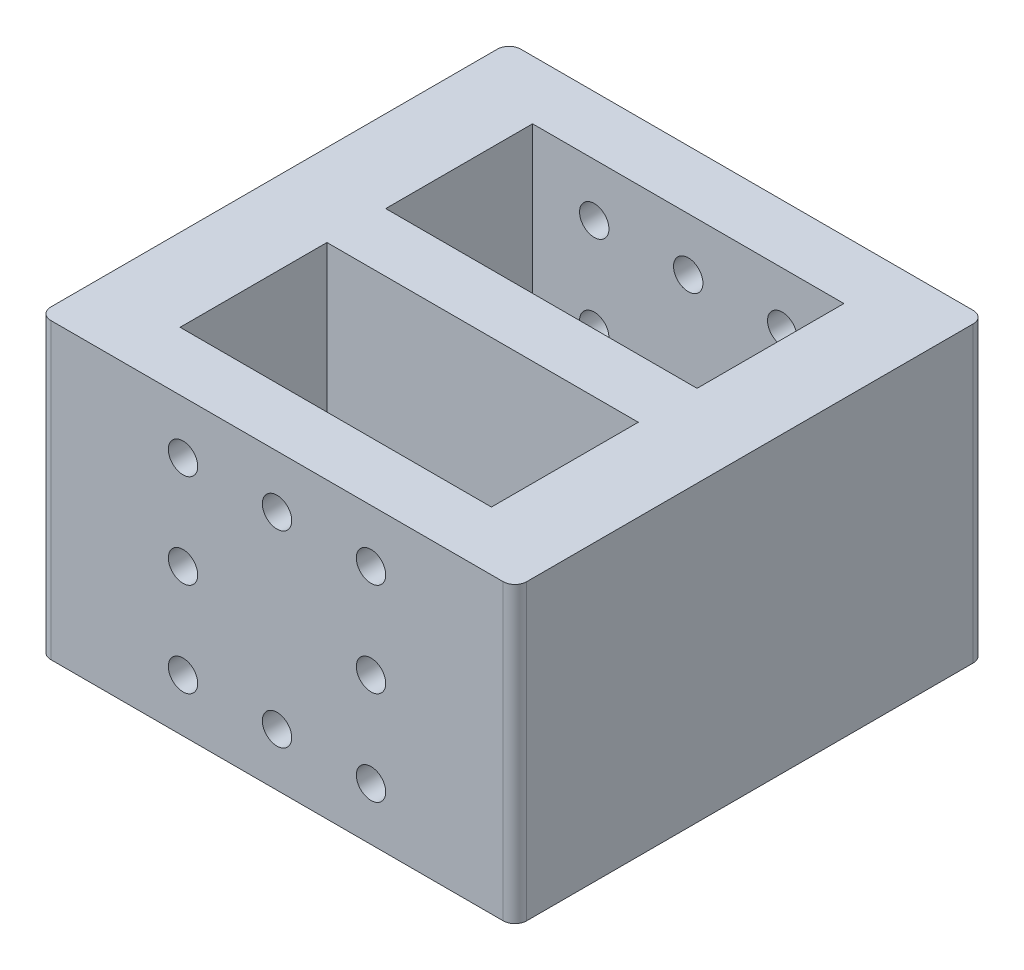
ISO-10303-21;
HEADER;
FILE_DESCRIPTION(('STEP AP214'),'2;1');
FILE_NAME('part.step','',(''),(''),'','','');
FILE_SCHEMA(('AUTOMOTIVE_DESIGN { 1 0 10303 214 1 1 1 1 }'));
ENDSEC;
DATA;
#1=APPLICATION_CONTEXT('core data for automotive mechanical design processes');
#2=APPLICATION_PROTOCOL_DEFINITION('international standard','automotive_design',2000,#1);
#3=PRODUCT_CONTEXT('',#1,'mechanical');
#4=PRODUCT('Part','Part','',(#3));
#5=PRODUCT_RELATED_PRODUCT_CATEGORY('part','',(#4));
#6=PRODUCT_DEFINITION_FORMATION('','',#4);
#7=PRODUCT_DEFINITION_CONTEXT('part definition',#1,'design');
#8=PRODUCT_DEFINITION('design','',#6,#7);
#9=PRODUCT_DEFINITION_SHAPE('','',#8);
#10=(LENGTH_UNIT() NAMED_UNIT(*) SI_UNIT(.MILLI.,.METRE.));
#11=(NAMED_UNIT(*) PLANE_ANGLE_UNIT() SI_UNIT($,.RADIAN.));
#12=(NAMED_UNIT(*) SI_UNIT($,.STERADIAN.) SOLID_ANGLE_UNIT());
#13=UNCERTAINTY_MEASURE_WITH_UNIT(LENGTH_MEASURE(1.E-05),#10,'distance_accuracy_value','');
#14=(GEOMETRIC_REPRESENTATION_CONTEXT(3) GLOBAL_UNCERTAINTY_ASSIGNED_CONTEXT((#13)) GLOBAL_UNIT_ASSIGNED_CONTEXT((#10,
#11,#12)) REPRESENTATION_CONTEXT('',''));
#15=CARTESIAN_POINT('',(0.,0.,0.));
#16=DIRECTION('',(0.,0.,1.));
#17=DIRECTION('',(1.,0.,0.));
#18=AXIS2_PLACEMENT_3D('',#15,#16,#17);
#19=CARTESIAN_POINT('',(6.99999999999999,25.,5.));
#20=DIRECTION('',(-1.,0.,0.));
#21=DIRECTION('',(0.,-1.,0.));
#22=AXIS2_PLACEMENT_3D('',#19,#20,#21);
#23=PLANE('',#22);
#24=DIRECTION('',(0.,1.,0.));
#25=VECTOR('',#24,1.);
#26=CARTESIAN_POINT('',(6.99999999999999,25.,17.5));
#27=LINE('',#26,#25);
#28=CARTESIAN_POINT('',(7.,0.,17.5));
#29=VERTEX_POINT('',#28);
#30=CARTESIAN_POINT('',(7.,25.,17.5));
#31=VERTEX_POINT('',#30);
#32=EDGE_CURVE('E182',#29,#31,#27,.T.);
#33=ORIENTED_EDGE('',*,*,#32,.F.);
#34=DIRECTION('',(0.,0.,1.));
#35=VECTOR('',#34,1.);
#36=CARTESIAN_POINT('',(7.,0.,5.));
#37=LINE('',#36,#35);
#38=CARTESIAN_POINT('',(7.,0.,5.));
#39=VERTEX_POINT('',#38);
#40=EDGE_CURVE('E162',#39,#29,#37,.T.);
#41=ORIENTED_EDGE('',*,*,#40,.F.);
#42=DIRECTION('',(0.,-1.,0.));
#43=VECTOR('',#42,1.);
#44=CARTESIAN_POINT('',(6.99999999999999,25.,5.));
#45=LINE('',#44,#43);
#46=CARTESIAN_POINT('',(6.99999999999999,25.,5.));
#47=VERTEX_POINT('',#46);
#48=EDGE_CURVE('E293',#47,#39,#45,.T.);
#49=ORIENTED_EDGE('',*,*,#48,.F.);
#50=DIRECTION('',(0.,0.,1.));
#51=VECTOR('',#50,1.);
#52=CARTESIAN_POINT('',(6.99999999999999,25.,5.));
#53=LINE('',#52,#51);
#54=EDGE_CURVE('E322',#47,#31,#53,.T.);
#55=ORIENTED_EDGE('',*,*,#54,.T.);
#56=EDGE_LOOP('',(#33,#41,#49,#55));
#57=FACE_BOUND('',#56,.T.);
#58=ADVANCED_FACE('F41',(#57),#23,.F.);
#59=CARTESIAN_POINT('',(33.5,25.,5.));
#60=DIRECTION('',(1.,0.,0.));
#61=DIRECTION('',(0.,1.,0.));
#62=AXIS2_PLACEMENT_3D('',#59,#60,#61);
#63=PLANE('',#62);
#64=DIRECTION('',(0.,-1.,0.));
#65=VECTOR('',#64,1.);
#66=CARTESIAN_POINT('',(33.5,25.,17.5));
#67=LINE('',#66,#65);
#68=CARTESIAN_POINT('',(33.5,25.,17.5));
#69=VERTEX_POINT('',#68);
#70=CARTESIAN_POINT('',(33.5,0.,17.5));
#71=VERTEX_POINT('',#70);
#72=EDGE_CURVE('E50',#69,#71,#67,.T.);
#73=ORIENTED_EDGE('',*,*,#72,.F.);
#74=DIRECTION('',(0.,0.,1.));
#75=VECTOR('',#74,1.);
#76=CARTESIAN_POINT('',(33.5,25.,5.));
#77=LINE('',#76,#75);
#78=CARTESIAN_POINT('',(33.5,25.,5.));
#79=VERTEX_POINT('',#78);
#80=EDGE_CURVE('E328',#79,#69,#77,.T.);
#81=ORIENTED_EDGE('',*,*,#80,.F.);
#82=DIRECTION('',(0.,1.,0.));
#83=VECTOR('',#82,1.);
#84=CARTESIAN_POINT('',(33.5,25.,5.));
#85=LINE('',#84,#83);
#86=CARTESIAN_POINT('',(33.5,0.,5.));
#87=VERTEX_POINT('',#86);
#88=EDGE_CURVE('E302',#87,#79,#85,.T.);
#89=ORIENTED_EDGE('',*,*,#88,.F.);
#90=DIRECTION('',(0.,0.,1.));
#91=VECTOR('',#90,1.);
#92=CARTESIAN_POINT('',(33.5,0.,5.));
#93=LINE('',#92,#91);
#94=EDGE_CURVE('E65',#87,#71,#93,.T.);
#95=ORIENTED_EDGE('',*,*,#94,.T.);
#96=EDGE_LOOP('',(#73,#81,#89,#95));
#97=FACE_BOUND('',#96,.T.);
#98=ADVANCED_FACE('F487',(#97),#63,.F.);
#99=CARTESIAN_POINT('',(0.,0.,40.));
#100=DIRECTION('',(0.,1.,0.));
#101=DIRECTION('',(0.,0.,1.));
#102=AXIS2_PLACEMENT_3D('',#99,#100,#101);
#103=PLANE('',#102);
#104=DIRECTION('',(1.,0.,0.));
#105=VECTOR('',#104,1.);
#106=CARTESIAN_POINT('',(0.,0.,22.5));
#107=LINE('',#106,#105);
#108=CARTESIAN_POINT('',(7.,0.,22.5));
#109=VERTEX_POINT('',#108);
#110=CARTESIAN_POINT('',(33.5,0.,22.5));
#111=VERTEX_POINT('',#110);
#112=EDGE_CURVE('E57',#109,#111,#107,.T.);
#113=ORIENTED_EDGE('',*,*,#112,.F.);
#114=CARTESIAN_POINT('',(7.,0.,35.));
#115=VERTEX_POINT('',#114);
#116=EDGE_CURVE('E310',#109,#115,#37,.T.);
#117=ORIENTED_EDGE('',*,*,#116,.T.);
#118=DIRECTION('',(1.,0.,0.));
#119=VECTOR('',#118,1.);
#120=CARTESIAN_POINT('',(7.,0.,35.));
#121=LINE('',#120,#119);
#122=CARTESIAN_POINT('',(33.5,0.,35.));
#123=VERTEX_POINT('',#122);
#124=EDGE_CURVE('E157',#115,#123,#121,.T.);
#125=ORIENTED_EDGE('',*,*,#124,.T.);
#126=EDGE_CURVE('E153',#111,#123,#93,.T.);
#127=ORIENTED_EDGE('',*,*,#126,.F.);
#128=EDGE_LOOP('',(#113,#117,#125,#127));
#129=FACE_BOUND('',#128,.T.);
#130=DIRECTION('',(0.,0.,-1.));
#131=VECTOR('',#130,1.);
#132=CARTESIAN_POINT('',(0.,0.,40.));
#133=LINE('',#132,#131);
#134=CARTESIAN_POINT('',(0.,0.,39.));
#135=VERTEX_POINT('',#134);
#136=CARTESIAN_POINT('',(0.,0.,1.));
#137=VERTEX_POINT('',#136);
#138=EDGE_CURVE('E360',#135,#137,#133,.T.);
#139=ORIENTED_EDGE('',*,*,#138,.T.);
#140=CARTESIAN_POINT('',(1.,0.,1.));
#141=DIRECTION('',(0.,1.,0.));
#142=DIRECTION('',(0.,0.,1.));
#143=AXIS2_PLACEMENT_3D('',#140,#141,#142);
#144=CIRCLE('',#143,1.);
#145=CARTESIAN_POINT('',(1.,0.,0.));
#146=VERTEX_POINT('',#145);
#147=EDGE_CURVE('E380',#137,#146,#144,.F.);
#148=ORIENTED_EDGE('',*,*,#147,.T.);
#149=DIRECTION('',(1.,0.,0.));
#150=VECTOR('',#149,1.);
#151=CARTESIAN_POINT('',(0.,0.,0.));
#152=LINE('',#151,#150);
#153=CARTESIAN_POINT('',(39.5,0.,0.));
#154=VERTEX_POINT('',#153);
#155=EDGE_CURVE('E326',#146,#154,#152,.T.);
#156=ORIENTED_EDGE('',*,*,#155,.T.);
#157=CARTESIAN_POINT('',(39.5,0.,1.));
#158=DIRECTION('',(0.,1.,0.));
#159=DIRECTION('',(0.,0.,1.));
#160=AXIS2_PLACEMENT_3D('',#157,#158,#159);
#161=CIRCLE('',#160,1.);
#162=CARTESIAN_POINT('',(40.5,0.,1.));
#163=VERTEX_POINT('',#162);
#164=EDGE_CURVE('E383',#154,#163,#161,.F.);
#165=ORIENTED_EDGE('',*,*,#164,.T.);
#166=DIRECTION('',(0.,0.,-1.));
#167=VECTOR('',#166,1.);
#168=CARTESIAN_POINT('',(40.5,0.,40.));
#169=LINE('',#168,#167);
#170=CARTESIAN_POINT('',(40.5,0.,39.));
#171=VERTEX_POINT('',#170);
#172=EDGE_CURVE('E357',#171,#163,#169,.T.);
#173=ORIENTED_EDGE('',*,*,#172,.F.);
#174=CARTESIAN_POINT('',(39.5,0.,39.));
#175=DIRECTION('',(0.,1.,0.));
#176=DIRECTION('',(0.,0.,1.));
#177=AXIS2_PLACEMENT_3D('',#174,#175,#176);
#178=CIRCLE('',#177,1.);
#179=CARTESIAN_POINT('',(39.5,0.,40.));
#180=VERTEX_POINT('',#179);
#181=EDGE_CURVE('E423',#171,#180,#178,.F.);
#182=ORIENTED_EDGE('',*,*,#181,.T.);
#183=DIRECTION('',(1.,0.,0.));
#184=VECTOR('',#183,1.);
#185=CARTESIAN_POINT('',(0.,0.,40.));
#186=LINE('',#185,#184);
#187=CARTESIAN_POINT('',(1.,0.,40.));
#188=VERTEX_POINT('',#187);
#189=EDGE_CURVE('E336',#188,#180,#186,.T.);
#190=ORIENTED_EDGE('',*,*,#189,.F.);
#191=CARTESIAN_POINT('',(1.,0.,39.));
#192=DIRECTION('',(0.,1.,0.));
#193=DIRECTION('',(0.,0.,1.));
#194=AXIS2_PLACEMENT_3D('',#191,#192,#193);
#195=CIRCLE('',#194,1.);
#196=EDGE_CURVE('E426',#188,#135,#195,.F.);
#197=ORIENTED_EDGE('',*,*,#196,.T.);
#198=EDGE_LOOP('',(#139,#148,#156,#165,#173,#182,#190,#197));
#199=FACE_BOUND('',#198,.T.);
#200=ORIENTED_EDGE('',*,*,#40,.T.);
#201=DIRECTION('',(1.,0.,0.));
#202=VECTOR('',#201,1.);
#203=CARTESIAN_POINT('',(0.,0.,17.5));
#204=LINE('',#203,#202);
#205=EDGE_CURVE('E174',#29,#71,#204,.T.);
#206=ORIENTED_EDGE('',*,*,#205,.T.);
#207=ORIENTED_EDGE('',*,*,#94,.F.);
#208=DIRECTION('',(1.,0.,0.));
#209=VECTOR('',#208,1.);
#210=CARTESIAN_POINT('',(7.,0.,5.));
#211=LINE('',#210,#209);
#212=EDGE_CURVE('E297',#39,#87,#211,.T.);
#213=ORIENTED_EDGE('',*,*,#212,.F.);
#214=EDGE_LOOP('',(#200,#206,#207,#213));
#215=FACE_BOUND('',#214,.T.);
#216=ADVANCED_FACE('F154',(#129,#199,#215),#103,.F.);
#217=CARTESIAN_POINT('',(0.,25.,40.));
#218=DIRECTION('',(0.,-1.,0.));
#219=DIRECTION('',(0.,0.,-1.));
#220=AXIS2_PLACEMENT_3D('',#217,#218,#219);
#221=PLANE('',#220);
#222=DIRECTION('',(1.,0.,0.));
#223=VECTOR('',#222,1.);
#224=CARTESIAN_POINT('',(0.,25.,22.5));
#225=LINE('',#224,#223);
#226=CARTESIAN_POINT('',(6.99999999999999,25.,22.5));
#227=VERTEX_POINT('',#226);
#228=CARTESIAN_POINT('',(33.5,25.,22.5));
#229=VERTEX_POINT('',#228);
#230=EDGE_CURVE('E185',#227,#229,#225,.T.);
#231=ORIENTED_EDGE('',*,*,#230,.T.);
#232=CARTESIAN_POINT('',(33.5,25.,35.));
#233=VERTEX_POINT('',#232);
#234=EDGE_CURVE('E166',#229,#233,#77,.T.);
#235=ORIENTED_EDGE('',*,*,#234,.T.);
#236=DIRECTION('',(-1.,0.,0.));
#237=VECTOR('',#236,1.);
#238=CARTESIAN_POINT('',(6.99999999999999,25.,35.));
#239=LINE('',#238,#237);
#240=CARTESIAN_POINT('',(6.99999999999999,25.,35.));
#241=VERTEX_POINT('',#240);
#242=EDGE_CURVE('E298',#233,#241,#239,.T.);
#243=ORIENTED_EDGE('',*,*,#242,.T.);
#244=EDGE_CURVE('E327',#227,#241,#53,.T.);
#245=ORIENTED_EDGE('',*,*,#244,.F.);
#246=EDGE_LOOP('',(#231,#235,#243,#245));
#247=FACE_BOUND('',#246,.T.);
#248=DIRECTION('',(0.,0.,-1.));
#249=VECTOR('',#248,1.);
#250=CARTESIAN_POINT('',(40.5,25.,40.));
#251=LINE('',#250,#249);
#252=CARTESIAN_POINT('',(40.5,25.,39.));
#253=VERTEX_POINT('',#252);
#254=CARTESIAN_POINT('',(40.5,25.,1.));
#255=VERTEX_POINT('',#254);
#256=EDGE_CURVE('E354',#253,#255,#251,.T.);
#257=ORIENTED_EDGE('',*,*,#256,.T.);
#258=CARTESIAN_POINT('',(39.5,25.,1.));
#259=DIRECTION('',(0.,-1.,0.));
#260=DIRECTION('',(0.,0.,-1.));
#261=AXIS2_PLACEMENT_3D('',#258,#259,#260);
#262=CIRCLE('',#261,1.);
#263=CARTESIAN_POINT('',(39.5,25.,0.));
#264=VERTEX_POINT('',#263);
#265=EDGE_CURVE('E371',#255,#264,#262,.F.);
#266=ORIENTED_EDGE('',*,*,#265,.T.);
#267=DIRECTION('',(-1.,0.,0.));
#268=VECTOR('',#267,1.);
#269=CARTESIAN_POINT('',(0.,25.,0.));
#270=LINE('',#269,#268);
#271=CARTESIAN_POINT('',(1.,25.,0.));
#272=VERTEX_POINT('',#271);
#273=EDGE_CURVE('E341',#264,#272,#270,.T.);
#274=ORIENTED_EDGE('',*,*,#273,.T.);
#275=CARTESIAN_POINT('',(1.,25.,1.));
#276=DIRECTION('',(0.,-1.,0.));
#277=DIRECTION('',(0.,0.,-1.));
#278=AXIS2_PLACEMENT_3D('',#275,#276,#277);
#279=CIRCLE('',#278,1.);
#280=CARTESIAN_POINT('',(0.,25.,1.));
#281=VERTEX_POINT('',#280);
#282=EDGE_CURVE('E367',#272,#281,#279,.F.);
#283=ORIENTED_EDGE('',*,*,#282,.T.);
#284=DIRECTION('',(0.,0.,-1.));
#285=VECTOR('',#284,1.);
#286=CARTESIAN_POINT('',(0.,25.,40.));
#287=LINE('',#286,#285);
#288=CARTESIAN_POINT('',(0.,25.,39.));
#289=VERTEX_POINT('',#288);
#290=EDGE_CURVE('E345',#289,#281,#287,.T.);
#291=ORIENTED_EDGE('',*,*,#290,.F.);
#292=CARTESIAN_POINT('',(1.,25.,39.));
#293=DIRECTION('',(0.,-1.,0.));
#294=DIRECTION('',(0.,0.,-1.));
#295=AXIS2_PLACEMENT_3D('',#292,#293,#294);
#296=CIRCLE('',#295,1.);
#297=CARTESIAN_POINT('',(1.,25.,40.));
#298=VERTEX_POINT('',#297);
#299=EDGE_CURVE('E435',#289,#298,#296,.F.);
#300=ORIENTED_EDGE('',*,*,#299,.T.);
#301=DIRECTION('',(-1.,0.,0.));
#302=VECTOR('',#301,1.);
#303=CARTESIAN_POINT('',(0.,25.,40.));
#304=LINE('',#303,#302);
#305=CARTESIAN_POINT('',(39.5,25.,40.));
#306=VERTEX_POINT('',#305);
#307=EDGE_CURVE('E340',#306,#298,#304,.T.);
#308=ORIENTED_EDGE('',*,*,#307,.F.);
#309=CARTESIAN_POINT('',(39.5,25.,39.));
#310=DIRECTION('',(0.,-1.,0.));
#311=DIRECTION('',(0.,0.,-1.));
#312=AXIS2_PLACEMENT_3D('',#309,#310,#311);
#313=CIRCLE('',#312,1.);
#314=EDGE_CURVE('E432',#306,#253,#313,.F.);
#315=ORIENTED_EDGE('',*,*,#314,.T.);
#316=EDGE_LOOP('',(#257,#266,#274,#283,#291,#300,#308,#315));
#317=FACE_BOUND('',#316,.T.);
#318=ORIENTED_EDGE('',*,*,#80,.T.);
#319=DIRECTION('',(1.,0.,0.));
#320=VECTOR('',#319,1.);
#321=CARTESIAN_POINT('',(0.,25.,17.5));
#322=LINE('',#321,#320);
#323=EDGE_CURVE('E178',#31,#69,#322,.T.);
#324=ORIENTED_EDGE('',*,*,#323,.F.);
#325=ORIENTED_EDGE('',*,*,#54,.F.);
#326=DIRECTION('',(-1.,0.,0.));
#327=VECTOR('',#326,1.);
#328=CARTESIAN_POINT('',(6.99999999999999,25.,5.));
#329=LINE('',#328,#327);
#330=EDGE_CURVE('E306',#79,#47,#329,.T.);
#331=ORIENTED_EDGE('',*,*,#330,.F.);
#332=EDGE_LOOP('',(#318,#324,#325,#331));
#333=FACE_BOUND('',#332,.T.);
#334=ADVANCED_FACE('F454',(#247,#317,#333),#221,.F.);
#335=CARTESIAN_POINT('',(0.,0.,40.));
#336=DIRECTION('',(1.,0.,0.));
#337=DIRECTION('',(0.,0.,-1.));
#338=AXIS2_PLACEMENT_3D('',#335,#336,#337);
#339=PLANE('',#338);
#340=ORIENTED_EDGE('',*,*,#290,.T.);
#341=DIRECTION('',(0.,-1.,0.));
#342=VECTOR('',#341,1.);
#343=CARTESIAN_POINT('',(0.,0.,1.));
#344=LINE('',#343,#342);
#345=EDGE_CURVE('E387',#281,#137,#344,.T.);
#346=ORIENTED_EDGE('',*,*,#345,.T.);
#347=ORIENTED_EDGE('',*,*,#138,.F.);
#348=DIRECTION('',(0.,-1.,0.));
#349=VECTOR('',#348,1.);
#350=CARTESIAN_POINT('',(0.,0.,39.));
#351=LINE('',#350,#349);
#352=EDGE_CURVE('E429',#135,#289,#351,.F.);
#353=ORIENTED_EDGE('',*,*,#352,.T.);
#354=EDGE_LOOP('',(#340,#346,#347,#353));
#355=FACE_BOUND('',#354,.T.);
#356=ADVANCED_FACE('F511',(#355),#339,.F.);
#357=CARTESIAN_POINT('',(40.5,0.,40.));
#358=DIRECTION('',(-1.,0.,0.));
#359=DIRECTION('',(0.,0.,1.));
#360=AXIS2_PLACEMENT_3D('',#357,#358,#359);
#361=PLANE('',#360);
#362=ORIENTED_EDGE('',*,*,#172,.T.);
#363=DIRECTION('',(0.,1.,0.));
#364=VECTOR('',#363,1.);
#365=CARTESIAN_POINT('',(40.5,25.,1.));
#366=LINE('',#365,#364);
#367=EDGE_CURVE('E363',#163,#255,#366,.T.);
#368=ORIENTED_EDGE('',*,*,#367,.T.);
#369=ORIENTED_EDGE('',*,*,#256,.F.);
#370=DIRECTION('',(0.,1.,0.));
#371=VECTOR('',#370,1.);
#372=CARTESIAN_POINT('',(40.5,0.,39.));
#373=LINE('',#372,#371);
#374=EDGE_CURVE('E438',#253,#171,#373,.F.);
#375=ORIENTED_EDGE('',*,*,#374,.T.);
#376=EDGE_LOOP('',(#362,#368,#369,#375));
#377=FACE_BOUND('',#376,.T.);
#378=ADVANCED_FACE('F505',(#377),#361,.F.);
#379=CARTESIAN_POINT('',(0.,0.,40.));
#380=DIRECTION('',(0.,0.,-1.));
#381=DIRECTION('',(-1.,0.,0.));
#382=AXIS2_PLACEMENT_3D('',#379,#380,#381);
#383=PLANE('',#382);
#384=CARTESIAN_POINT('',(28.25,20.5,40.));
#385=DIRECTION('',(0.,0.,1.));
#386=DIRECTION('',(1.,0.,0.));
#387=AXIS2_PLACEMENT_3D('',#384,#385,#386);
#388=CIRCLE('',#387,1.25);
#389=CARTESIAN_POINT('',(29.5,20.5,40.));
#390=VERTEX_POINT('',#389);
#391=EDGE_CURVE('E235',#390,#390,#388,.T.);
#392=ORIENTED_EDGE('',*,*,#391,.F.);
#393=EDGE_LOOP('',(#392));
#394=FACE_BOUND('',#393,.T.);
#395=CARTESIAN_POINT('',(28.25,12.5,40.));
#396=DIRECTION('',(0.,0.,1.));
#397=DIRECTION('',(1.,0.,0.));
#398=AXIS2_PLACEMENT_3D('',#395,#396,#397);
#399=CIRCLE('',#398,1.25);
#400=CARTESIAN_POINT('',(29.5,12.5,40.));
#401=VERTEX_POINT('',#400);
#402=EDGE_CURVE('E227',#401,#401,#399,.T.);
#403=ORIENTED_EDGE('',*,*,#402,.F.);
#404=EDGE_LOOP('',(#403));
#405=FACE_BOUND('',#404,.T.);
#406=CARTESIAN_POINT('',(28.25,4.50000000000002,40.));
#407=DIRECTION('',(0.,0.,1.));
#408=DIRECTION('',(1.,0.,0.));
#409=AXIS2_PLACEMENT_3D('',#406,#407,#408);
#410=CIRCLE('',#409,1.25);
#411=CARTESIAN_POINT('',(29.5,4.50000000000002,40.));
#412=VERTEX_POINT('',#411);
#413=EDGE_CURVE('E219',#412,#412,#410,.T.);
#414=ORIENTED_EDGE('',*,*,#413,.F.);
#415=EDGE_LOOP('',(#414));
#416=FACE_BOUND('',#415,.T.);
#417=CARTESIAN_POINT('',(20.25,20.5,40.));
#418=DIRECTION('',(0.,0.,1.));
#419=DIRECTION('',(1.,0.,0.));
#420=AXIS2_PLACEMENT_3D('',#417,#418,#419);
#421=CIRCLE('',#420,1.25);
#422=CARTESIAN_POINT('',(21.5,20.5,40.));
#423=VERTEX_POINT('',#422);
#424=EDGE_CURVE('E211',#423,#423,#421,.T.);
#425=ORIENTED_EDGE('',*,*,#424,.F.);
#426=EDGE_LOOP('',(#425));
#427=FACE_BOUND('',#426,.T.);
#428=CARTESIAN_POINT('',(12.25,20.5,40.));
#429=DIRECTION('',(0.,0.,1.));
#430=DIRECTION('',(1.,0.,0.));
#431=AXIS2_PLACEMENT_3D('',#428,#429,#430);
#432=CIRCLE('',#431,1.25);
#433=CARTESIAN_POINT('',(13.5,20.5,40.));
#434=VERTEX_POINT('',#433);
#435=EDGE_CURVE('E203',#434,#434,#432,.T.);
#436=ORIENTED_EDGE('',*,*,#435,.F.);
#437=EDGE_LOOP('',(#436));
#438=FACE_BOUND('',#437,.T.);
#439=CARTESIAN_POINT('',(12.25,12.5,40.));
#440=DIRECTION('',(0.,0.,1.));
#441=DIRECTION('',(1.,0.,0.));
#442=AXIS2_PLACEMENT_3D('',#439,#440,#441);
#443=CIRCLE('',#442,1.25);
#444=CARTESIAN_POINT('',(13.5,12.5,40.));
#445=VERTEX_POINT('',#444);
#446=EDGE_CURVE('E194',#445,#445,#443,.T.);
#447=ORIENTED_EDGE('',*,*,#446,.F.);
#448=EDGE_LOOP('',(#447));
#449=FACE_BOUND('',#448,.T.);
#450=CARTESIAN_POINT('',(20.25,4.50000000000002,40.));
#451=DIRECTION('',(0.,0.,1.));
#452=DIRECTION('',(1.,0.,0.));
#453=AXIS2_PLACEMENT_3D('',#450,#451,#452);
#454=CIRCLE('',#453,1.25);
#455=CARTESIAN_POINT('',(21.5,4.50000000000002,40.));
#456=VERTEX_POINT('',#455);
#457=EDGE_CURVE('E193',#456,#456,#454,.T.);
#458=ORIENTED_EDGE('',*,*,#457,.F.);
#459=EDGE_LOOP('',(#458));
#460=FACE_BOUND('',#459,.T.);
#461=CARTESIAN_POINT('',(12.25,4.50000000000002,40.));
#462=DIRECTION('',(0.,0.,1.));
#463=DIRECTION('',(1.,0.,0.));
#464=AXIS2_PLACEMENT_3D('',#461,#462,#463);
#465=CIRCLE('',#464,1.25);
#466=CARTESIAN_POINT('',(13.5,4.50000000000002,40.));
#467=VERTEX_POINT('',#466);
#468=EDGE_CURVE('E248',#467,#467,#465,.T.);
#469=ORIENTED_EDGE('',*,*,#468,.F.);
#470=EDGE_LOOP('',(#469));
#471=FACE_BOUND('',#470,.T.);
#472=ORIENTED_EDGE('',*,*,#307,.T.);
#473=DIRECTION('',(0.,-1.,0.));
#474=VECTOR('',#473,1.);
#475=CARTESIAN_POINT('',(1.,0.,40.));
#476=LINE('',#475,#474);
#477=EDGE_CURVE('E419',#298,#188,#476,.T.);
#478=ORIENTED_EDGE('',*,*,#477,.T.);
#479=ORIENTED_EDGE('',*,*,#189,.T.);
#480=DIRECTION('',(0.,1.,0.));
#481=VECTOR('',#480,1.);
#482=CARTESIAN_POINT('',(39.5,0.,40.));
#483=LINE('',#482,#481);
#484=EDGE_CURVE('E391',#180,#306,#483,.T.);
#485=ORIENTED_EDGE('',*,*,#484,.T.);
#486=EDGE_LOOP('',(#472,#478,#479,#485));
#487=FACE_BOUND('',#486,.T.);
#488=ADVANCED_FACE('F499',(#394,#405,#416,#427,#438,#449,#460,#471,#487),#383,.F.);
#489=CARTESIAN_POINT('',(0.,0.,0.));
#490=DIRECTION('',(0.,0.,-1.));
#491=DIRECTION('',(-1.,0.,0.));
#492=AXIS2_PLACEMENT_3D('',#489,#490,#491);
#493=PLANE('',#492);
#494=CARTESIAN_POINT('',(28.25,20.5,0.));
#495=DIRECTION('',(0.,0.,1.));
#496=DIRECTION('',(1.,0.,0.));
#497=AXIS2_PLACEMENT_3D('',#494,#495,#496);
#498=CIRCLE('',#497,1.25);
#499=CARTESIAN_POINT('',(29.5,20.5,0.));
#500=VERTEX_POINT('',#499);
#501=EDGE_CURVE('E188',#500,#500,#498,.T.);
#502=ORIENTED_EDGE('',*,*,#501,.T.);
#503=EDGE_LOOP('',(#502));
#504=FACE_BOUND('',#503,.T.);
#505=CARTESIAN_POINT('',(28.25,12.5,0.));
#506=DIRECTION('',(0.,0.,1.));
#507=DIRECTION('',(1.,0.,0.));
#508=AXIS2_PLACEMENT_3D('',#505,#506,#507);
#509=CIRCLE('',#508,1.25);
#510=CARTESIAN_POINT('',(29.5,12.5,0.));
#511=VERTEX_POINT('',#510);
#512=EDGE_CURVE('E231',#511,#511,#509,.T.);
#513=ORIENTED_EDGE('',*,*,#512,.T.);
#514=EDGE_LOOP('',(#513));
#515=FACE_BOUND('',#514,.T.);
#516=CARTESIAN_POINT('',(28.25,4.50000000000002,0.));
#517=DIRECTION('',(0.,0.,1.));
#518=DIRECTION('',(1.,0.,0.));
#519=AXIS2_PLACEMENT_3D('',#516,#517,#518);
#520=CIRCLE('',#519,1.25);
#521=CARTESIAN_POINT('',(29.5,4.50000000000002,0.));
#522=VERTEX_POINT('',#521);
#523=EDGE_CURVE('E223',#522,#522,#520,.T.);
#524=ORIENTED_EDGE('',*,*,#523,.T.);
#525=EDGE_LOOP('',(#524));
#526=FACE_BOUND('',#525,.T.);
#527=CARTESIAN_POINT('',(20.25,20.5,0.));
#528=DIRECTION('',(0.,0.,1.));
#529=DIRECTION('',(1.,0.,0.));
#530=AXIS2_PLACEMENT_3D('',#527,#528,#529);
#531=CIRCLE('',#530,1.25);
#532=CARTESIAN_POINT('',(21.5,20.5,0.));
#533=VERTEX_POINT('',#532);
#534=EDGE_CURVE('E215',#533,#533,#531,.T.);
#535=ORIENTED_EDGE('',*,*,#534,.T.);
#536=EDGE_LOOP('',(#535));
#537=FACE_BOUND('',#536,.T.);
#538=CARTESIAN_POINT('',(12.25,20.5,0.));
#539=DIRECTION('',(0.,0.,1.));
#540=DIRECTION('',(1.,0.,0.));
#541=AXIS2_PLACEMENT_3D('',#538,#539,#540);
#542=CIRCLE('',#541,1.25);
#543=CARTESIAN_POINT('',(13.5,20.5,0.));
#544=VERTEX_POINT('',#543);
#545=EDGE_CURVE('E207',#544,#544,#542,.T.);
#546=ORIENTED_EDGE('',*,*,#545,.T.);
#547=EDGE_LOOP('',(#546));
#548=FACE_BOUND('',#547,.T.);
#549=CARTESIAN_POINT('',(12.25,12.5,0.));
#550=DIRECTION('',(0.,0.,1.));
#551=DIRECTION('',(1.,0.,0.));
#552=AXIS2_PLACEMENT_3D('',#549,#550,#551);
#553=CIRCLE('',#552,1.25);
#554=CARTESIAN_POINT('',(13.5,12.5,0.));
#555=VERTEX_POINT('',#554);
#556=EDGE_CURVE('E199',#555,#555,#553,.T.);
#557=ORIENTED_EDGE('',*,*,#556,.T.);
#558=EDGE_LOOP('',(#557));
#559=FACE_BOUND('',#558,.T.);
#560=CARTESIAN_POINT('',(20.25,4.50000000000002,0.));
#561=DIRECTION('',(0.,0.,1.));
#562=DIRECTION('',(1.,0.,0.));
#563=AXIS2_PLACEMENT_3D('',#560,#561,#562);
#564=CIRCLE('',#563,1.25);
#565=CARTESIAN_POINT('',(21.5,4.50000000000002,0.));
#566=VERTEX_POINT('',#565);
#567=EDGE_CURVE('E189',#566,#566,#564,.T.);
#568=ORIENTED_EDGE('',*,*,#567,.T.);
#569=EDGE_LOOP('',(#568));
#570=FACE_BOUND('',#569,.T.);
#571=CARTESIAN_POINT('',(12.25,4.50000000000002,0.));
#572=DIRECTION('',(0.,0.,1.));
#573=DIRECTION('',(1.,0.,0.));
#574=AXIS2_PLACEMENT_3D('',#571,#572,#573);
#575=CIRCLE('',#574,1.25);
#576=CARTESIAN_POINT('',(13.5,4.50000000000002,0.));
#577=VERTEX_POINT('',#576);
#578=EDGE_CURVE('E198',#577,#577,#575,.T.);
#579=ORIENTED_EDGE('',*,*,#578,.T.);
#580=EDGE_LOOP('',(#579));
#581=FACE_BOUND('',#580,.T.);
#582=ORIENTED_EDGE('',*,*,#273,.F.);
#583=DIRECTION('',(0.,1.,0.));
#584=VECTOR('',#583,1.);
#585=CARTESIAN_POINT('',(39.5,0.,0.));
#586=LINE('',#585,#584);
#587=EDGE_CURVE('E377',#264,#154,#586,.F.);
#588=ORIENTED_EDGE('',*,*,#587,.T.);
#589=ORIENTED_EDGE('',*,*,#155,.F.);
#590=DIRECTION('',(0.,-1.,0.));
#591=VECTOR('',#590,1.);
#592=CARTESIAN_POINT('',(1.,25.,0.));
#593=LINE('',#592,#591);
#594=EDGE_CURVE('E374',#146,#272,#593,.F.);
#595=ORIENTED_EDGE('',*,*,#594,.T.);
#596=EDGE_LOOP('',(#582,#588,#589,#595));
#597=FACE_BOUND('',#596,.T.);
#598=ADVANCED_FACE('F494',(#504,#515,#526,#537,#548,#559,#570,#581,#597),#493,.T.);
#599=ORIENTED_EDGE('',*,*,#116,.F.);
#600=DIRECTION('',(0.,1.,0.));
#601=VECTOR('',#600,1.);
#602=CARTESIAN_POINT('',(6.99999999999999,25.,22.5));
#603=LINE('',#602,#601);
#604=EDGE_CURVE('E171',#109,#227,#603,.T.);
#605=ORIENTED_EDGE('',*,*,#604,.T.);
#606=ORIENTED_EDGE('',*,*,#244,.T.);
#607=DIRECTION('',(0.,-1.,0.));
#608=VECTOR('',#607,1.);
#609=CARTESIAN_POINT('',(6.99999999999999,25.,35.));
#610=LINE('',#609,#608);
#611=EDGE_CURVE('E292',#241,#115,#610,.T.);
#612=ORIENTED_EDGE('',*,*,#611,.T.);
#613=EDGE_LOOP('',(#599,#605,#606,#612));
#614=FACE_BOUND('',#613,.T.);
#615=ADVANCED_FACE('F462',(#614),#23,.F.);
#616=ORIENTED_EDGE('',*,*,#234,.F.);
#617=DIRECTION('',(0.,-1.,0.));
#618=VECTOR('',#617,1.);
#619=CARTESIAN_POINT('',(33.5,25.,22.5));
#620=LINE('',#619,#618);
#621=EDGE_CURVE('E11',#229,#111,#620,.T.);
#622=ORIENTED_EDGE('',*,*,#621,.T.);
#623=ORIENTED_EDGE('',*,*,#126,.T.);
#624=DIRECTION('',(0.,1.,0.));
#625=VECTOR('',#624,1.);
#626=CARTESIAN_POINT('',(33.5,25.,35.));
#627=LINE('',#626,#625);
#628=EDGE_CURVE('E316',#123,#233,#627,.T.);
#629=ORIENTED_EDGE('',*,*,#628,.T.);
#630=EDGE_LOOP('',(#616,#622,#623,#629));
#631=FACE_BOUND('',#630,.T.);
#632=ADVANCED_FACE('F165',(#631),#63,.F.);
#633=CARTESIAN_POINT('',(0.,0.,5.));
#634=DIRECTION('',(0.,0.,1.));
#635=DIRECTION('',(1.,0.,0.));
#636=AXIS2_PLACEMENT_3D('',#633,#634,#635);
#637=PLANE('',#636);
#638=CARTESIAN_POINT('',(28.25,20.5,5.));
#639=DIRECTION('',(0.,0.,1.));
#640=DIRECTION('',(1.,0.,0.));
#641=AXIS2_PLACEMENT_3D('',#638,#639,#640);
#642=CIRCLE('',#641,1.25);
#643=CARTESIAN_POINT('',(29.5,20.5,5.));
#644=VERTEX_POINT('',#643);
#645=EDGE_CURVE('E288',#644,#644,#642,.F.);
#646=ORIENTED_EDGE('',*,*,#645,.T.);
#647=EDGE_LOOP('',(#646));
#648=FACE_BOUND('',#647,.T.);
#649=CARTESIAN_POINT('',(28.25,12.5,5.));
#650=DIRECTION('',(0.,0.,1.));
#651=DIRECTION('',(1.,0.,0.));
#652=AXIS2_PLACEMENT_3D('',#649,#650,#651);
#653=CIRCLE('',#652,1.25);
#654=CARTESIAN_POINT('',(29.5,12.5,5.));
#655=VERTEX_POINT('',#654);
#656=EDGE_CURVE('E283',#655,#655,#653,.F.);
#657=ORIENTED_EDGE('',*,*,#656,.T.);
#658=EDGE_LOOP('',(#657));
#659=FACE_BOUND('',#658,.T.);
#660=CARTESIAN_POINT('',(28.25,4.50000000000002,5.));
#661=DIRECTION('',(0.,0.,1.));
#662=DIRECTION('',(1.,0.,0.));
#663=AXIS2_PLACEMENT_3D('',#660,#661,#662);
#664=CIRCLE('',#663,1.25);
#665=CARTESIAN_POINT('',(29.5,4.50000000000002,5.));
#666=VERTEX_POINT('',#665);
#667=EDGE_CURVE('E278',#666,#666,#664,.F.);
#668=ORIENTED_EDGE('',*,*,#667,.T.);
#669=EDGE_LOOP('',(#668));
#670=FACE_BOUND('',#669,.T.);
#671=CARTESIAN_POINT('',(20.25,20.5,5.));
#672=DIRECTION('',(0.,0.,1.));
#673=DIRECTION('',(1.,0.,0.));
#674=AXIS2_PLACEMENT_3D('',#671,#672,#673);
#675=CIRCLE('',#674,1.25);
#676=CARTESIAN_POINT('',(21.5,20.5,5.));
#677=VERTEX_POINT('',#676);
#678=EDGE_CURVE('E273',#677,#677,#675,.F.);
#679=ORIENTED_EDGE('',*,*,#678,.T.);
#680=EDGE_LOOP('',(#679));
#681=FACE_BOUND('',#680,.T.);
#682=CARTESIAN_POINT('',(12.25,20.5,5.));
#683=DIRECTION('',(0.,0.,1.));
#684=DIRECTION('',(1.,0.,0.));
#685=AXIS2_PLACEMENT_3D('',#682,#683,#684);
#686=CIRCLE('',#685,1.25);
#687=CARTESIAN_POINT('',(13.5,20.5,5.));
#688=VERTEX_POINT('',#687);
#689=EDGE_CURVE('E268',#688,#688,#686,.F.);
#690=ORIENTED_EDGE('',*,*,#689,.T.);
#691=EDGE_LOOP('',(#690));
#692=FACE_BOUND('',#691,.T.);
#693=CARTESIAN_POINT('',(12.25,12.5,5.));
#694=DIRECTION('',(0.,0.,1.));
#695=DIRECTION('',(1.,0.,0.));
#696=AXIS2_PLACEMENT_3D('',#693,#694,#695);
#697=CIRCLE('',#696,1.25);
#698=CARTESIAN_POINT('',(13.5,12.5,5.));
#699=VERTEX_POINT('',#698);
#700=EDGE_CURVE('E263',#699,#699,#697,.F.);
#701=ORIENTED_EDGE('',*,*,#700,.T.);
#702=EDGE_LOOP('',(#701));
#703=FACE_BOUND('',#702,.T.);
#704=CARTESIAN_POINT('',(20.25,4.50000000000002,5.));
#705=DIRECTION('',(0.,0.,1.));
#706=DIRECTION('',(1.,0.,0.));
#707=AXIS2_PLACEMENT_3D('',#704,#705,#706);
#708=CIRCLE('',#707,1.25);
#709=CARTESIAN_POINT('',(21.5,4.50000000000002,5.));
#710=VERTEX_POINT('',#709);
#711=EDGE_CURVE('E258',#710,#710,#708,.F.);
#712=ORIENTED_EDGE('',*,*,#711,.T.);
#713=EDGE_LOOP('',(#712));
#714=FACE_BOUND('',#713,.T.);
#715=CARTESIAN_POINT('',(12.25,4.50000000000002,5.));
#716=DIRECTION('',(0.,0.,1.));
#717=DIRECTION('',(1.,0.,0.));
#718=AXIS2_PLACEMENT_3D('',#715,#716,#717);
#719=CIRCLE('',#718,1.25);
#720=CARTESIAN_POINT('',(13.5,4.50000000000002,5.));
#721=VERTEX_POINT('',#720);
#722=EDGE_CURVE('E253',#721,#721,#719,.F.);
#723=ORIENTED_EDGE('',*,*,#722,.T.);
#724=EDGE_LOOP('',(#723));
#725=FACE_BOUND('',#724,.T.);
#726=ORIENTED_EDGE('',*,*,#48,.T.);
#727=ORIENTED_EDGE('',*,*,#212,.T.);
#728=ORIENTED_EDGE('',*,*,#88,.T.);
#729=ORIENTED_EDGE('',*,*,#330,.T.);
#730=EDGE_LOOP('',(#726,#727,#728,#729));
#731=FACE_BOUND('',#730,.T.);
#732=ADVANCED_FACE('F450',(#648,#659,#670,#681,#692,#703,#714,#725,#731),#637,.T.);
#733=CARTESIAN_POINT('',(0.,0.,35.));
#734=DIRECTION('',(0.,0.,1.));
#735=DIRECTION('',(1.,0.,0.));
#736=AXIS2_PLACEMENT_3D('',#733,#734,#735);
#737=PLANE('',#736);
#738=CARTESIAN_POINT('',(28.25,20.5,35.));
#739=DIRECTION('',(0.,0.,1.));
#740=DIRECTION('',(1.,0.,0.));
#741=AXIS2_PLACEMENT_3D('',#738,#739,#740);
#742=CIRCLE('',#741,1.25);
#743=CARTESIAN_POINT('',(29.5,20.5,35.));
#744=VERTEX_POINT('',#743);
#745=EDGE_CURVE('E287',#744,#744,#742,.F.);
#746=ORIENTED_EDGE('',*,*,#745,.F.);
#747=EDGE_LOOP('',(#746));
#748=FACE_BOUND('',#747,.T.);
#749=CARTESIAN_POINT('',(28.25,12.5,35.));
#750=DIRECTION('',(0.,0.,1.));
#751=DIRECTION('',(1.,0.,0.));
#752=AXIS2_PLACEMENT_3D('',#749,#750,#751);
#753=CIRCLE('',#752,1.25);
#754=CARTESIAN_POINT('',(29.5,12.5,35.));
#755=VERTEX_POINT('',#754);
#756=EDGE_CURVE('E282',#755,#755,#753,.F.);
#757=ORIENTED_EDGE('',*,*,#756,.F.);
#758=EDGE_LOOP('',(#757));
#759=FACE_BOUND('',#758,.T.);
#760=CARTESIAN_POINT('',(28.25,4.50000000000002,35.));
#761=DIRECTION('',(0.,0.,1.));
#762=DIRECTION('',(1.,0.,0.));
#763=AXIS2_PLACEMENT_3D('',#760,#761,#762);
#764=CIRCLE('',#763,1.25);
#765=CARTESIAN_POINT('',(29.5,4.50000000000002,35.));
#766=VERTEX_POINT('',#765);
#767=EDGE_CURVE('E277',#766,#766,#764,.F.);
#768=ORIENTED_EDGE('',*,*,#767,.F.);
#769=EDGE_LOOP('',(#768));
#770=FACE_BOUND('',#769,.T.);
#771=CARTESIAN_POINT('',(20.25,20.5,35.));
#772=DIRECTION('',(0.,0.,1.));
#773=DIRECTION('',(1.,0.,0.));
#774=AXIS2_PLACEMENT_3D('',#771,#772,#773);
#775=CIRCLE('',#774,1.25);
#776=CARTESIAN_POINT('',(21.5,20.5,35.));
#777=VERTEX_POINT('',#776);
#778=EDGE_CURVE('E272',#777,#777,#775,.F.);
#779=ORIENTED_EDGE('',*,*,#778,.F.);
#780=EDGE_LOOP('',(#779));
#781=FACE_BOUND('',#780,.T.);
#782=CARTESIAN_POINT('',(12.25,20.5,35.));
#783=DIRECTION('',(0.,0.,1.));
#784=DIRECTION('',(1.,0.,0.));
#785=AXIS2_PLACEMENT_3D('',#782,#783,#784);
#786=CIRCLE('',#785,1.25);
#787=CARTESIAN_POINT('',(13.5,20.5,35.));
#788=VERTEX_POINT('',#787);
#789=EDGE_CURVE('E267',#788,#788,#786,.F.);
#790=ORIENTED_EDGE('',*,*,#789,.F.);
#791=EDGE_LOOP('',(#790));
#792=FACE_BOUND('',#791,.T.);
#793=CARTESIAN_POINT('',(12.25,12.5,35.));
#794=DIRECTION('',(0.,0.,1.));
#795=DIRECTION('',(1.,0.,0.));
#796=AXIS2_PLACEMENT_3D('',#793,#794,#795);
#797=CIRCLE('',#796,1.25);
#798=CARTESIAN_POINT('',(13.5,12.5,35.));
#799=VERTEX_POINT('',#798);
#800=EDGE_CURVE('E262',#799,#799,#797,.F.);
#801=ORIENTED_EDGE('',*,*,#800,.F.);
#802=EDGE_LOOP('',(#801));
#803=FACE_BOUND('',#802,.T.);
#804=CARTESIAN_POINT('',(20.25,4.50000000000002,35.));
#805=DIRECTION('',(0.,0.,1.));
#806=DIRECTION('',(1.,0.,0.));
#807=AXIS2_PLACEMENT_3D('',#804,#805,#806);
#808=CIRCLE('',#807,1.25);
#809=CARTESIAN_POINT('',(21.5,4.50000000000002,35.));
#810=VERTEX_POINT('',#809);
#811=EDGE_CURVE('E257',#810,#810,#808,.F.);
#812=ORIENTED_EDGE('',*,*,#811,.F.);
#813=EDGE_LOOP('',(#812));
#814=FACE_BOUND('',#813,.T.);
#815=CARTESIAN_POINT('',(12.25,4.50000000000002,35.));
#816=DIRECTION('',(0.,0.,1.));
#817=DIRECTION('',(1.,0.,0.));
#818=AXIS2_PLACEMENT_3D('',#815,#816,#817);
#819=CIRCLE('',#818,1.25);
#820=CARTESIAN_POINT('',(13.5,4.50000000000002,35.));
#821=VERTEX_POINT('',#820);
#822=EDGE_CURVE('E252',#821,#821,#819,.F.);
#823=ORIENTED_EDGE('',*,*,#822,.F.);
#824=EDGE_LOOP('',(#823));
#825=FACE_BOUND('',#824,.T.);
#826=ORIENTED_EDGE('',*,*,#611,.F.);
#827=ORIENTED_EDGE('',*,*,#242,.F.);
#828=ORIENTED_EDGE('',*,*,#628,.F.);
#829=ORIENTED_EDGE('',*,*,#124,.F.);
#830=EDGE_LOOP('',(#826,#827,#828,#829));
#831=FACE_BOUND('',#830,.T.);
#832=ADVANCED_FACE('F468',(#748,#759,#770,#781,#792,#803,#814,#825,#831),#737,.F.);
#833=CARTESIAN_POINT('',(39.5,0.,1.));
#834=DIRECTION('',(0.,-1.,0.));
#835=DIRECTION('',(0.,0.,-1.));
#836=AXIS2_PLACEMENT_3D('',#833,#834,#835);
#837=CYLINDRICAL_SURFACE('',#836,1.);
#838=ORIENTED_EDGE('',*,*,#164,.F.);
#839=ORIENTED_EDGE('',*,*,#587,.F.);
#840=ORIENTED_EDGE('',*,*,#265,.F.);
#841=ORIENTED_EDGE('',*,*,#367,.F.);
#842=EDGE_LOOP('',(#838,#839,#840,#841));
#843=FACE_BOUND('',#842,.T.);
#844=ADVANCED_FACE('F471',(#843),#837,.T.);
#845=CARTESIAN_POINT('',(1.,0.,1.));
#846=DIRECTION('',(0.,1.,0.));
#847=DIRECTION('',(0.,0.,1.));
#848=AXIS2_PLACEMENT_3D('',#845,#846,#847);
#849=CYLINDRICAL_SURFACE('',#848,1.);
#850=ORIENTED_EDGE('',*,*,#282,.F.);
#851=ORIENTED_EDGE('',*,*,#594,.F.);
#852=ORIENTED_EDGE('',*,*,#147,.F.);
#853=ORIENTED_EDGE('',*,*,#345,.F.);
#854=EDGE_LOOP('',(#850,#851,#852,#853));
#855=FACE_BOUND('',#854,.T.);
#856=ADVANCED_FACE('F478',(#855),#849,.T.);
#857=CARTESIAN_POINT('',(12.25,4.50000000000002,40.));
#858=DIRECTION('',(0.,0.,-1.));
#859=DIRECTION('',(-1.,0.,0.));
#860=AXIS2_PLACEMENT_3D('',#857,#858,#859);
#861=CYLINDRICAL_SURFACE('',#860,1.25);
#862=ORIENTED_EDGE('',*,*,#468,.T.);
#863=EDGE_LOOP('',(#862));
#864=FACE_BOUND('',#863,.T.);
#865=ORIENTED_EDGE('',*,*,#822,.T.);
#866=EDGE_LOOP('',(#865));
#867=FACE_BOUND('',#866,.T.);
#868=ADVANCED_FACE('F521',(#864,#867),#861,.F.);
#869=CARTESIAN_POINT('',(20.25,4.50000000000002,40.));
#870=DIRECTION('',(0.,0.,-1.));
#871=DIRECTION('',(-1.,0.,0.));
#872=AXIS2_PLACEMENT_3D('',#869,#870,#871);
#873=CYLINDRICAL_SURFACE('',#872,1.25);
#874=ORIENTED_EDGE('',*,*,#457,.T.);
#875=EDGE_LOOP('',(#874));
#876=FACE_BOUND('',#875,.T.);
#877=ORIENTED_EDGE('',*,*,#811,.T.);
#878=EDGE_LOOP('',(#877));
#879=FACE_BOUND('',#878,.T.);
#880=ADVANCED_FACE('F600',(#876,#879),#873,.F.);
#881=CARTESIAN_POINT('',(12.25,12.5,40.));
#882=DIRECTION('',(0.,0.,-1.));
#883=DIRECTION('',(-1.,0.,0.));
#884=AXIS2_PLACEMENT_3D('',#881,#882,#883);
#885=CYLINDRICAL_SURFACE('',#884,1.25);
#886=ORIENTED_EDGE('',*,*,#446,.T.);
#887=EDGE_LOOP('',(#886));
#888=FACE_BOUND('',#887,.T.);
#889=ORIENTED_EDGE('',*,*,#800,.T.);
#890=EDGE_LOOP('',(#889));
#891=FACE_BOUND('',#890,.T.);
#892=ADVANCED_FACE('F606',(#888,#891),#885,.F.);
#893=CARTESIAN_POINT('',(12.25,20.5,40.));
#894=DIRECTION('',(0.,0.,-1.));
#895=DIRECTION('',(-1.,0.,0.));
#896=AXIS2_PLACEMENT_3D('',#893,#894,#895);
#897=CYLINDRICAL_SURFACE('',#896,1.25);
#898=ORIENTED_EDGE('',*,*,#435,.T.);
#899=EDGE_LOOP('',(#898));
#900=FACE_BOUND('',#899,.T.);
#901=ORIENTED_EDGE('',*,*,#789,.T.);
#902=EDGE_LOOP('',(#901));
#903=FACE_BOUND('',#902,.T.);
#904=ADVANCED_FACE('F612',(#900,#903),#897,.F.);
#905=CARTESIAN_POINT('',(20.25,20.5,40.));
#906=DIRECTION('',(0.,0.,-1.));
#907=DIRECTION('',(-1.,0.,0.));
#908=AXIS2_PLACEMENT_3D('',#905,#906,#907);
#909=CYLINDRICAL_SURFACE('',#908,1.25);
#910=ORIENTED_EDGE('',*,*,#424,.T.);
#911=EDGE_LOOP('',(#910));
#912=FACE_BOUND('',#911,.T.);
#913=ORIENTED_EDGE('',*,*,#778,.T.);
#914=EDGE_LOOP('',(#913));
#915=FACE_BOUND('',#914,.T.);
#916=ADVANCED_FACE('F647',(#912,#915),#909,.F.);
#917=CARTESIAN_POINT('',(28.25,4.50000000000002,40.));
#918=DIRECTION('',(0.,0.,-1.));
#919=DIRECTION('',(-1.,0.,0.));
#920=AXIS2_PLACEMENT_3D('',#917,#918,#919);
#921=CYLINDRICAL_SURFACE('',#920,1.25);
#922=ORIENTED_EDGE('',*,*,#413,.T.);
#923=EDGE_LOOP('',(#922));
#924=FACE_BOUND('',#923,.T.);
#925=ORIENTED_EDGE('',*,*,#767,.T.);
#926=EDGE_LOOP('',(#925));
#927=FACE_BOUND('',#926,.T.);
#928=ADVANCED_FACE('F579',(#924,#927),#921,.F.);
#929=CARTESIAN_POINT('',(28.25,12.5,40.));
#930=DIRECTION('',(0.,0.,-1.));
#931=DIRECTION('',(-1.,0.,0.));
#932=AXIS2_PLACEMENT_3D('',#929,#930,#931);
#933=CYLINDRICAL_SURFACE('',#932,1.25);
#934=ORIENTED_EDGE('',*,*,#402,.T.);
#935=EDGE_LOOP('',(#934));
#936=FACE_BOUND('',#935,.T.);
#937=ORIENTED_EDGE('',*,*,#756,.T.);
#938=EDGE_LOOP('',(#937));
#939=FACE_BOUND('',#938,.T.);
#940=ADVANCED_FACE('F566',(#936,#939),#933,.F.);
#941=CARTESIAN_POINT('',(28.25,20.5,40.));
#942=DIRECTION('',(0.,0.,-1.));
#943=DIRECTION('',(-1.,0.,0.));
#944=AXIS2_PLACEMENT_3D('',#941,#942,#943);
#945=CYLINDRICAL_SURFACE('',#944,1.25);
#946=ORIENTED_EDGE('',*,*,#391,.T.);
#947=EDGE_LOOP('',(#946));
#948=FACE_BOUND('',#947,.T.);
#949=ORIENTED_EDGE('',*,*,#745,.T.);
#950=EDGE_LOOP('',(#949));
#951=FACE_BOUND('',#950,.T.);
#952=ADVANCED_FACE('F535',(#948,#951),#945,.F.);
#953=ORIENTED_EDGE('',*,*,#722,.F.);
#954=EDGE_LOOP('',(#953));
#955=FACE_BOUND('',#954,.T.);
#956=ORIENTED_EDGE('',*,*,#578,.F.);
#957=EDGE_LOOP('',(#956));
#958=FACE_BOUND('',#957,.T.);
#959=ADVANCED_FACE('F571',(#955,#958),#861,.F.);
#960=ORIENTED_EDGE('',*,*,#711,.F.);
#961=EDGE_LOOP('',(#960));
#962=FACE_BOUND('',#961,.T.);
#963=ORIENTED_EDGE('',*,*,#567,.F.);
#964=EDGE_LOOP('',(#963));
#965=FACE_BOUND('',#964,.T.);
#966=ADVANCED_FACE('F577',(#962,#965),#873,.F.);
#967=ORIENTED_EDGE('',*,*,#700,.F.);
#968=EDGE_LOOP('',(#967));
#969=FACE_BOUND('',#968,.T.);
#970=ORIENTED_EDGE('',*,*,#556,.F.);
#971=EDGE_LOOP('',(#970));
#972=FACE_BOUND('',#971,.T.);
#973=ADVANCED_FACE('F615',(#969,#972),#885,.F.);
#974=ORIENTED_EDGE('',*,*,#689,.F.);
#975=EDGE_LOOP('',(#974));
#976=FACE_BOUND('',#975,.T.);
#977=ORIENTED_EDGE('',*,*,#545,.F.);
#978=EDGE_LOOP('',(#977));
#979=FACE_BOUND('',#978,.T.);
#980=ADVANCED_FACE('F623',(#976,#979),#897,.F.);
#981=ORIENTED_EDGE('',*,*,#678,.F.);
#982=EDGE_LOOP('',(#981));
#983=FACE_BOUND('',#982,.T.);
#984=ORIENTED_EDGE('',*,*,#534,.F.);
#985=EDGE_LOOP('',(#984));
#986=FACE_BOUND('',#985,.T.);
#987=ADVANCED_FACE('F638',(#983,#986),#909,.F.);
#988=ORIENTED_EDGE('',*,*,#667,.F.);
#989=EDGE_LOOP('',(#988));
#990=FACE_BOUND('',#989,.T.);
#991=ORIENTED_EDGE('',*,*,#523,.F.);
#992=EDGE_LOOP('',(#991));
#993=FACE_BOUND('',#992,.T.);
#994=ADVANCED_FACE('F563',(#990,#993),#921,.F.);
#995=ORIENTED_EDGE('',*,*,#656,.F.);
#996=EDGE_LOOP('',(#995));
#997=FACE_BOUND('',#996,.T.);
#998=ORIENTED_EDGE('',*,*,#512,.F.);
#999=EDGE_LOOP('',(#998));
#1000=FACE_BOUND('',#999,.T.);
#1001=ADVANCED_FACE('F532',(#997,#1000),#933,.F.);
#1002=ORIENTED_EDGE('',*,*,#645,.F.);
#1003=EDGE_LOOP('',(#1002));
#1004=FACE_BOUND('',#1003,.T.);
#1005=ORIENTED_EDGE('',*,*,#501,.F.);
#1006=EDGE_LOOP('',(#1005));
#1007=FACE_BOUND('',#1006,.T.);
#1008=ADVANCED_FACE('F525',(#1004,#1007),#945,.F.);
#1009=CARTESIAN_POINT('',(1.,0.,39.));
#1010=DIRECTION('',(0.,-1.,0.));
#1011=DIRECTION('',(0.,0.,-1.));
#1012=AXIS2_PLACEMENT_3D('',#1009,#1010,#1011);
#1013=CYLINDRICAL_SURFACE('',#1012,1.);
#1014=ORIENTED_EDGE('',*,*,#299,.F.);
#1015=ORIENTED_EDGE('',*,*,#352,.F.);
#1016=ORIENTED_EDGE('',*,*,#196,.F.);
#1017=ORIENTED_EDGE('',*,*,#477,.F.);
#1018=EDGE_LOOP('',(#1014,#1015,#1016,#1017));
#1019=FACE_BOUND('',#1018,.T.);
#1020=ADVANCED_FACE('F523',(#1019),#1013,.T.);
#1021=CARTESIAN_POINT('',(39.5,0.,39.));
#1022=DIRECTION('',(0.,1.,0.));
#1023=DIRECTION('',(0.,0.,1.));
#1024=AXIS2_PLACEMENT_3D('',#1021,#1022,#1023);
#1025=CYLINDRICAL_SURFACE('',#1024,1.);
#1026=ORIENTED_EDGE('',*,*,#181,.F.);
#1027=ORIENTED_EDGE('',*,*,#374,.F.);
#1028=ORIENTED_EDGE('',*,*,#314,.F.);
#1029=ORIENTED_EDGE('',*,*,#484,.F.);
#1030=EDGE_LOOP('',(#1026,#1027,#1028,#1029));
#1031=FACE_BOUND('',#1030,.T.);
#1032=ADVANCED_FACE('F43',(#1031),#1025,.T.);
#1033=CARTESIAN_POINT('',(0.,25.,22.5));
#1034=DIRECTION('',(0.,0.,1.));
#1035=DIRECTION('',(1.,0.,0.));
#1036=AXIS2_PLACEMENT_3D('',#1033,#1034,#1035);
#1037=PLANE('',#1036);
#1038=ORIENTED_EDGE('',*,*,#604,.F.);
#1039=ORIENTED_EDGE('',*,*,#112,.T.);
#1040=ORIENTED_EDGE('',*,*,#621,.F.);
#1041=ORIENTED_EDGE('',*,*,#230,.F.);
#1042=EDGE_LOOP('',(#1038,#1039,#1040,#1041));
#1043=FACE_BOUND('',#1042,.T.);
#1044=ADVANCED_FACE('F169',(#1043),#1037,.T.);
#1045=CARTESIAN_POINT('',(0.,25.,17.5));
#1046=DIRECTION('',(0.,0.,1.));
#1047=DIRECTION('',(1.,0.,0.));
#1048=AXIS2_PLACEMENT_3D('',#1045,#1046,#1047);
#1049=PLANE('',#1048);
#1050=ORIENTED_EDGE('',*,*,#205,.F.);
#1051=ORIENTED_EDGE('',*,*,#32,.T.);
#1052=ORIENTED_EDGE('',*,*,#323,.T.);
#1053=ORIENTED_EDGE('',*,*,#72,.T.);
#1054=EDGE_LOOP('',(#1050,#1051,#1052,#1053));
#1055=FACE_BOUND('',#1054,.T.);
#1056=ADVANCED_FACE('F443',(#1055),#1049,.F.);
#1057=CLOSED_SHELL('',(#58,#98,#216,#334,#356,#378,#488,#598,#615,#632,#732,#832,#844,#856,#868,
#880,#892,#904,#916,#928,#940,#952,#959,#966,#973,#980,#987,#994,#1001,#1008,#1020,#1032,#1044,#1056));
#1058=MANIFOLD_SOLID_BREP('B2',#1057);
#1059=ADVANCED_BREP_SHAPE_REPRESENTATION('',(#18,#1058),#14);
#1060=SHAPE_DEFINITION_REPRESENTATION(#9,#1059);
ENDSEC;
END-ISO-10303-21;
